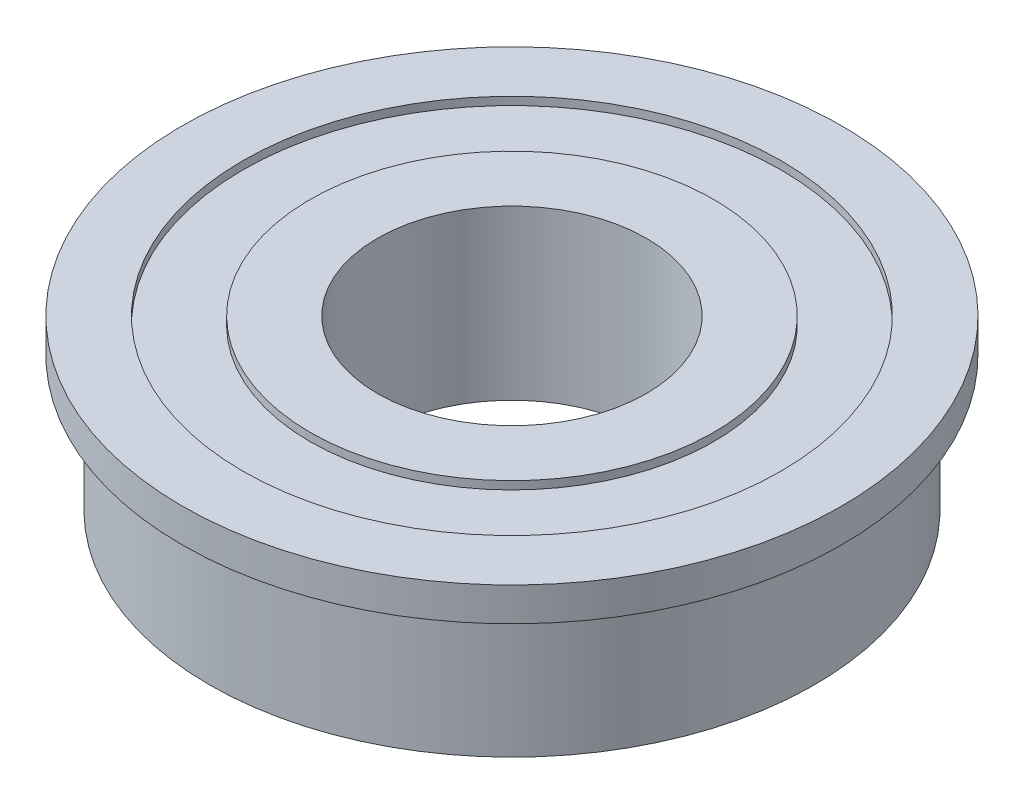
ISO-10303-21;
HEADER;
FILE_DESCRIPTION(('STEP AP214'),'2;1');
FILE_NAME('part.step','',(''),(''),'','','');
FILE_SCHEMA(('AUTOMOTIVE_DESIGN { 1 0 10303 214 1 1 1 1 }'));
ENDSEC;
DATA;
#1=APPLICATION_CONTEXT('core data for automotive mechanical design processes');
#2=APPLICATION_PROTOCOL_DEFINITION('international standard','automotive_design',2000,#1);
#3=PRODUCT_CONTEXT('',#1,'mechanical');
#4=PRODUCT('Part','Part','',(#3));
#5=PRODUCT_RELATED_PRODUCT_CATEGORY('part','',(#4));
#6=PRODUCT_DEFINITION_FORMATION('','',#4);
#7=PRODUCT_DEFINITION_CONTEXT('part definition',#1,'design');
#8=PRODUCT_DEFINITION('design','',#6,#7);
#9=PRODUCT_DEFINITION_SHAPE('','',#8);
#10=(LENGTH_UNIT() NAMED_UNIT(*) SI_UNIT(.MILLI.,.METRE.));
#11=(NAMED_UNIT(*) PLANE_ANGLE_UNIT() SI_UNIT($,.RADIAN.));
#12=(NAMED_UNIT(*) SI_UNIT($,.STERADIAN.) SOLID_ANGLE_UNIT());
#13=UNCERTAINTY_MEASURE_WITH_UNIT(LENGTH_MEASURE(1.E-05),#10,'distance_accuracy_value','');
#14=(GEOMETRIC_REPRESENTATION_CONTEXT(3) GLOBAL_UNCERTAINTY_ASSIGNED_CONTEXT((#13)) GLOBAL_UNIT_ASSIGNED_CONTEXT((#10,
#11,#12)) REPRESENTATION_CONTEXT('',''));
#15=CARTESIAN_POINT('',(0.,0.,0.));
#16=DIRECTION('',(0.,0.,1.));
#17=DIRECTION('',(1.,0.,0.));
#18=AXIS2_PLACEMENT_3D('',#15,#16,#17);
#19=CARTESIAN_POINT('',(0.,0.,0.));
#20=DIRECTION('',(0.,1.,0.));
#21=DIRECTION('',(0.,0.,1.));
#22=AXIS2_PLACEMENT_3D('',#19,#20,#21);
#23=CYLINDRICAL_SURFACE('',#22,12.7);
#24=CARTESIAN_POINT('',(0.,7.9375,0.));
#25=DIRECTION('',(0.,1.,0.));
#26=DIRECTION('',(0.,0.,1.));
#27=AXIS2_PLACEMENT_3D('',#24,#25,#26);
#28=CIRCLE('',#27,12.7);
#29=CARTESIAN_POINT('',(0.,7.9375,12.7));
#30=VERTEX_POINT('',#29);
#31=EDGE_CURVE('E45',#30,#30,#28,.F.);
#32=ORIENTED_EDGE('',*,*,#31,.F.);
#33=EDGE_LOOP('',(#32));
#34=FACE_BOUND('',#33,.T.);
#35=CARTESIAN_POINT('',(0.,7.5565,0.));
#36=DIRECTION('',(0.,1.,0.));
#37=DIRECTION('',(0.,0.,1.));
#38=AXIS2_PLACEMENT_3D('',#35,#36,#37);
#39=CIRCLE('',#38,12.7);
#40=CARTESIAN_POINT('',(0.,7.5565,12.7));
#41=VERTEX_POINT('',#40);
#42=EDGE_CURVE('E17',#41,#41,#39,.T.);
#43=ORIENTED_EDGE('',*,*,#42,.F.);
#44=EDGE_LOOP('',(#43));
#45=FACE_BOUND('',#44,.T.);
#46=ADVANCED_FACE('F14',(#34,#45),#23,.F.);
#47=CARTESIAN_POINT('',(9.525,7.5565,0.));
#48=DIRECTION('',(0.,1.,0.));
#49=DIRECTION('',(0.,0.,1.));
#50=AXIS2_PLACEMENT_3D('',#47,#48,#49);
#51=PLANE('',#50);
#52=CARTESIAN_POINT('',(0.,7.5565,0.));
#53=DIRECTION('',(0.,1.,0.));
#54=DIRECTION('',(0.,0.,1.));
#55=AXIS2_PLACEMENT_3D('',#52,#53,#54);
#56=CIRCLE('',#55,9.525);
#57=CARTESIAN_POINT('',(0.,7.5565,9.525));
#58=VERTEX_POINT('',#57);
#59=EDGE_CURVE('E43',#58,#58,#56,.T.);
#60=ORIENTED_EDGE('',*,*,#59,.F.);
#61=EDGE_LOOP('',(#60));
#62=FACE_BOUND('',#61,.T.);
#63=ORIENTED_EDGE('',*,*,#42,.T.);
#64=EDGE_LOOP('',(#63));
#65=FACE_BOUND('',#64,.T.);
#66=ADVANCED_FACE('F52',(#62,#65),#51,.T.);
#67=CARTESIAN_POINT('',(12.7,7.9375,0.));
#68=DIRECTION('',(0.,1.,0.));
#69=DIRECTION('',(0.,0.,1.));
#70=AXIS2_PLACEMENT_3D('',#67,#68,#69);
#71=PLANE('',#70);
#72=ORIENTED_EDGE('',*,*,#31,.T.);
#73=EDGE_LOOP('',(#72));
#74=FACE_BOUND('',#73,.T.);
#75=CARTESIAN_POINT('',(0.,7.9375,0.));
#76=DIRECTION('',(0.,1.,0.));
#77=DIRECTION('',(0.,0.,1.));
#78=AXIS2_PLACEMENT_3D('',#75,#76,#77);
#79=CIRCLE('',#78,15.5575);
#80=CARTESIAN_POINT('',(0.,7.9375,15.5575));
#81=VERTEX_POINT('',#80);
#82=EDGE_CURVE('E40',#81,#81,#79,.F.);
#83=ORIENTED_EDGE('',*,*,#82,.F.);
#84=EDGE_LOOP('',(#83));
#85=FACE_BOUND('',#84,.T.);
#86=ADVANCED_FACE('F60',(#74,#85),#71,.T.);
#87=CARTESIAN_POINT('',(0.,0.,0.));
#88=DIRECTION('',(0.,1.,0.));
#89=DIRECTION('',(0.,0.,1.));
#90=AXIS2_PLACEMENT_3D('',#87,#88,#89);
#91=CYLINDRICAL_SURFACE('',#90,9.525);
#92=ORIENTED_EDGE('',*,*,#59,.T.);
#93=EDGE_LOOP('',(#92));
#94=FACE_BOUND('',#93,.T.);
#95=CARTESIAN_POINT('',(0.,7.9375,0.));
#96=DIRECTION('',(0.,1.,0.));
#97=DIRECTION('',(0.,0.,1.));
#98=AXIS2_PLACEMENT_3D('',#95,#96,#97);
#99=CIRCLE('',#98,9.525);
#100=CARTESIAN_POINT('',(0.,7.9375,9.525));
#101=VERTEX_POINT('',#100);
#102=EDGE_CURVE('E37',#101,#101,#99,.T.);
#103=ORIENTED_EDGE('',*,*,#102,.F.);
#104=EDGE_LOOP('',(#103));
#105=FACE_BOUND('',#104,.T.);
#106=ADVANCED_FACE('F88',(#94,#105),#91,.T.);
#107=CARTESIAN_POINT('',(0.,0.,0.));
#108=DIRECTION('',(0.,1.,0.));
#109=DIRECTION('',(0.,0.,1.));
#110=AXIS2_PLACEMENT_3D('',#107,#108,#109);
#111=CYLINDRICAL_SURFACE('',#110,15.5575);
#112=CARTESIAN_POINT('',(0.,6.35,0.));
#113=DIRECTION('',(0.,1.,0.));
#114=DIRECTION('',(0.,0.,1.));
#115=AXIS2_PLACEMENT_3D('',#112,#113,#114);
#116=CIRCLE('',#115,15.5575);
#117=CARTESIAN_POINT('',(0.,6.35,15.5575));
#118=VERTEX_POINT('',#117);
#119=EDGE_CURVE('E34',#118,#118,#116,.F.);
#120=ORIENTED_EDGE('',*,*,#119,.F.);
#121=EDGE_LOOP('',(#120));
#122=FACE_BOUND('',#121,.T.);
#123=ORIENTED_EDGE('',*,*,#82,.T.);
#124=EDGE_LOOP('',(#123));
#125=FACE_BOUND('',#124,.T.);
#126=ADVANCED_FACE('F84',(#122,#125),#111,.T.);
#127=CARTESIAN_POINT('',(6.35,7.9375,0.));
#128=DIRECTION('',(0.,1.,0.));
#129=DIRECTION('',(0.,0.,1.));
#130=AXIS2_PLACEMENT_3D('',#127,#128,#129);
#131=PLANE('',#130);
#132=CARTESIAN_POINT('',(0.,7.9375,0.));
#133=DIRECTION('',(0.,1.,0.));
#134=DIRECTION('',(0.,0.,1.));
#135=AXIS2_PLACEMENT_3D('',#132,#133,#134);
#136=CIRCLE('',#135,6.35);
#137=CARTESIAN_POINT('',(0.,7.9375,6.35));
#138=VERTEX_POINT('',#137);
#139=EDGE_CURVE('E31',#138,#138,#136,.F.);
#140=ORIENTED_EDGE('',*,*,#139,.T.);
#141=EDGE_LOOP('',(#140));
#142=FACE_BOUND('',#141,.T.);
#143=ORIENTED_EDGE('',*,*,#102,.T.);
#144=EDGE_LOOP('',(#143));
#145=FACE_BOUND('',#144,.T.);
#146=ADVANCED_FACE('F80',(#142,#145),#131,.T.);
#147=CARTESIAN_POINT('',(15.5575,6.35,0.));
#148=DIRECTION('',(0.,-1.,0.));
#149=DIRECTION('',(0.,0.,-1.));
#150=AXIS2_PLACEMENT_3D('',#147,#148,#149);
#151=PLANE('',#150);
#152=ORIENTED_EDGE('',*,*,#119,.T.);
#153=EDGE_LOOP('',(#152));
#154=FACE_BOUND('',#153,.T.);
#155=CARTESIAN_POINT('',(0.,6.35,0.));
#156=DIRECTION('',(0.,1.,0.));
#157=DIRECTION('',(0.,0.,1.));
#158=AXIS2_PLACEMENT_3D('',#155,#156,#157);
#159=CIRCLE('',#158,14.2875);
#160=CARTESIAN_POINT('',(0.,6.35,14.2875));
#161=VERTEX_POINT('',#160);
#162=EDGE_CURVE('E26',#161,#161,#159,.F.);
#163=ORIENTED_EDGE('',*,*,#162,.F.);
#164=EDGE_LOOP('',(#163));
#165=FACE_BOUND('',#164,.T.);
#166=ADVANCED_FACE('F76',(#154,#165),#151,.T.);
#167=CARTESIAN_POINT('',(0.,0.,0.));
#168=DIRECTION('',(0.,1.,0.));
#169=DIRECTION('',(0.,0.,1.));
#170=AXIS2_PLACEMENT_3D('',#167,#168,#169);
#171=CYLINDRICAL_SURFACE('',#170,6.35);
#172=ORIENTED_EDGE('',*,*,#139,.F.);
#173=EDGE_LOOP('',(#172));
#174=FACE_BOUND('',#173,.T.);
#175=CARTESIAN_POINT('',(0.,0.,0.));
#176=DIRECTION('',(0.,1.,0.));
#177=DIRECTION('',(0.,0.,1.));
#178=AXIS2_PLACEMENT_3D('',#175,#176,#177);
#179=CIRCLE('',#178,6.35);
#180=CARTESIAN_POINT('',(0.,0.,6.35));
#181=VERTEX_POINT('',#180);
#182=EDGE_CURVE('E21',#181,#181,#179,.T.);
#183=ORIENTED_EDGE('',*,*,#182,.F.);
#184=EDGE_LOOP('',(#183));
#185=FACE_BOUND('',#184,.T.);
#186=ADVANCED_FACE('F69',(#174,#185),#171,.F.);
#187=CARTESIAN_POINT('',(0.,0.,0.));
#188=DIRECTION('',(0.,1.,0.));
#189=DIRECTION('',(0.,0.,1.));
#190=AXIS2_PLACEMENT_3D('',#187,#188,#189);
#191=CYLINDRICAL_SURFACE('',#190,14.2875);
#192=CARTESIAN_POINT('',(0.,0.,0.));
#193=DIRECTION('',(0.,1.,0.));
#194=DIRECTION('',(0.,0.,1.));
#195=AXIS2_PLACEMENT_3D('',#192,#193,#194);
#196=CIRCLE('',#195,14.2875);
#197=CARTESIAN_POINT('',(0.,0.,14.2875));
#198=VERTEX_POINT('',#197);
#199=EDGE_CURVE('E10',#198,#198,#196,.F.);
#200=ORIENTED_EDGE('',*,*,#199,.F.);
#201=EDGE_LOOP('',(#200));
#202=FACE_BOUND('',#201,.T.);
#203=ORIENTED_EDGE('',*,*,#162,.T.);
#204=EDGE_LOOP('',(#203));
#205=FACE_BOUND('',#204,.T.);
#206=ADVANCED_FACE('F64',(#202,#205),#191,.T.);
#207=CARTESIAN_POINT('',(14.2875,0.,0.));
#208=DIRECTION('',(0.,-1.,0.));
#209=DIRECTION('',(0.,0.,-1.));
#210=AXIS2_PLACEMENT_3D('',#207,#208,#209);
#211=PLANE('',#210);
#212=ORIENTED_EDGE('',*,*,#199,.T.);
#213=EDGE_LOOP('',(#212));
#214=FACE_BOUND('',#213,.T.);
#215=ORIENTED_EDGE('',*,*,#182,.T.);
#216=EDGE_LOOP('',(#215));
#217=FACE_BOUND('',#216,.T.);
#218=ADVANCED_FACE('F62',(#214,#217),#211,.T.);
#219=CLOSED_SHELL('',(#46,#66,#86,#106,#126,#146,#166,#186,#206,#218));
#220=MANIFOLD_SOLID_BREP('B1',#219);
#221=ADVANCED_BREP_SHAPE_REPRESENTATION('',(#18,#220),#14);
#222=SHAPE_DEFINITION_REPRESENTATION(#9,#221);
ENDSEC;
END-ISO-10303-21;
